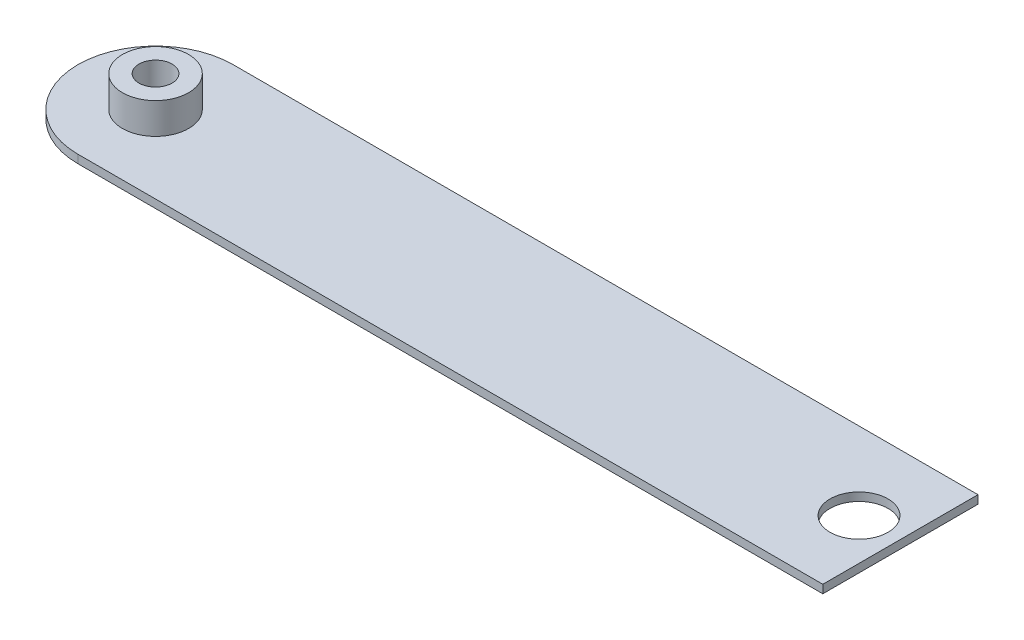
ISO-10303-21;
HEADER;
FILE_DESCRIPTION(('STEP AP214'),'2;1');
FILE_NAME('part.step','',(''),(''),'','','');
FILE_SCHEMA(('AUTOMOTIVE_DESIGN { 1 0 10303 214 1 1 1 1 }'));
ENDSEC;
DATA;
#1=APPLICATION_CONTEXT('core data for automotive mechanical design processes');
#2=APPLICATION_PROTOCOL_DEFINITION('international standard','automotive_design',2000,#1);
#3=PRODUCT_CONTEXT('',#1,'mechanical');
#4=PRODUCT('Part','Part','',(#3));
#5=PRODUCT_RELATED_PRODUCT_CATEGORY('part','',(#4));
#6=PRODUCT_DEFINITION_FORMATION('','',#4);
#7=PRODUCT_DEFINITION_CONTEXT('part definition',#1,'design');
#8=PRODUCT_DEFINITION('design','',#6,#7);
#9=PRODUCT_DEFINITION_SHAPE('','',#8);
#10=(LENGTH_UNIT() NAMED_UNIT(*) SI_UNIT(.MILLI.,.METRE.));
#11=(NAMED_UNIT(*) PLANE_ANGLE_UNIT() SI_UNIT($,.RADIAN.));
#12=(NAMED_UNIT(*) SI_UNIT($,.STERADIAN.) SOLID_ANGLE_UNIT());
#13=UNCERTAINTY_MEASURE_WITH_UNIT(LENGTH_MEASURE(1.E-05),#10,'distance_accuracy_value','');
#14=(GEOMETRIC_REPRESENTATION_CONTEXT(3) GLOBAL_UNCERTAINTY_ASSIGNED_CONTEXT((#13)) GLOBAL_UNIT_ASSIGNED_CONTEXT((#10,
#11,#12)) REPRESENTATION_CONTEXT('',''));
#15=CARTESIAN_POINT('',(0.,0.,0.));
#16=DIRECTION('',(0.,0.,1.));
#17=DIRECTION('',(1.,0.,0.));
#18=AXIS2_PLACEMENT_3D('',#15,#16,#17);
#19=CARTESIAN_POINT('',(0.,2.,0.));
#20=DIRECTION('',(0.,1.,0.));
#21=DIRECTION('',(0.,0.,1.));
#22=AXIS2_PLACEMENT_3D('',#19,#20,#21);
#23=PLANE('',#22);
#24=DIRECTION('',(1.,0.,0.));
#25=VECTOR('',#24,1.);
#26=CARTESIAN_POINT('',(0.,2.,-7.5));
#27=LINE('',#26,#25);
#28=CARTESIAN_POINT('',(0.,2.,-7.5));
#29=VERTEX_POINT('',#28);
#30=CARTESIAN_POINT('',(72.,2.,-7.5));
#31=VERTEX_POINT('',#30);
#32=EDGE_CURVE('E118',#29,#31,#27,.T.);
#33=ORIENTED_EDGE('',*,*,#32,.F.);
#34=CARTESIAN_POINT('',(0.,2.,0.));
#35=DIRECTION('',(0.,1.,0.));
#36=DIRECTION('',(0.,0.,1.));
#37=AXIS2_PLACEMENT_3D('',#34,#35,#36);
#38=CIRCLE('',#37,7.5);
#39=CARTESIAN_POINT('',(0.,2.,7.5));
#40=VERTEX_POINT('',#39);
#41=EDGE_CURVE('E115',#29,#40,#38,.T.);
#42=ORIENTED_EDGE('',*,*,#41,.T.);
#43=DIRECTION('',(1.,0.,0.));
#44=VECTOR('',#43,1.);
#45=CARTESIAN_POINT('',(0.,2.,7.5));
#46=LINE('',#45,#44);
#47=CARTESIAN_POINT('',(72.,2.,7.5));
#48=VERTEX_POINT('',#47);
#49=EDGE_CURVE('E112',#40,#48,#46,.T.);
#50=ORIENTED_EDGE('',*,*,#49,.T.);
#51=DIRECTION('',(0.,0.,-1.));
#52=VECTOR('',#51,1.);
#53=CARTESIAN_POINT('',(72.,2.,0.));
#54=LINE('',#53,#52);
#55=EDGE_CURVE('E66',#48,#31,#54,.T.);
#56=ORIENTED_EDGE('',*,*,#55,.T.);
#57=EDGE_LOOP('',(#33,#42,#50,#56));
#58=FACE_BOUND('',#57,.T.);
#59=CARTESIAN_POINT('',(68.,2.,0.));
#60=DIRECTION('',(0.,1.,0.));
#61=DIRECTION('',(0.,0.,1.));
#62=AXIS2_PLACEMENT_3D('',#59,#60,#61);
#63=CIRCLE('',#62,2.79999999999999);
#64=CARTESIAN_POINT('',(68.,2.,2.79999999999999));
#65=VERTEX_POINT('',#64);
#66=EDGE_CURVE('E122',#65,#65,#63,.T.);
#67=ORIENTED_EDGE('',*,*,#66,.F.);
#68=EDGE_LOOP('',(#67));
#69=FACE_BOUND('',#68,.T.);
#70=CARTESIAN_POINT('',(0.,2.,0.));
#71=DIRECTION('',(0.,1.,0.));
#72=DIRECTION('',(0.,0.,1.));
#73=AXIS2_PLACEMENT_3D('',#70,#71,#72);
#74=CIRCLE('',#73,3.2);
#75=CARTESIAN_POINT('',(0.,2.,3.2));
#76=VERTEX_POINT('',#75);
#77=EDGE_CURVE('E127',#76,#76,#74,.T.);
#78=ORIENTED_EDGE('',*,*,#77,.F.);
#79=EDGE_LOOP('',(#78));
#80=FACE_BOUND('',#79,.T.);
#81=ADVANCED_FACE('F41',(#58,#69,#80),#23,.T.);
#82=CARTESIAN_POINT('',(0.,2.,-7.5));
#83=DIRECTION('',(0.,0.,-1.));
#84=DIRECTION('',(-1.,0.,0.));
#85=AXIS2_PLACEMENT_3D('',#82,#83,#84);
#86=PLANE('',#85);
#87=DIRECTION('',(1.,0.,0.));
#88=VECTOR('',#87,1.);
#89=CARTESIAN_POINT('',(72.,1.2,-7.5));
#90=LINE('',#89,#88);
#91=CARTESIAN_POINT('',(0.,1.2,-7.5));
#92=VERTEX_POINT('',#91);
#93=CARTESIAN_POINT('',(72.,1.2,-7.5));
#94=VERTEX_POINT('',#93);
#95=EDGE_CURVE('E58',#92,#94,#90,.T.);
#96=ORIENTED_EDGE('',*,*,#95,.F.);
#97=DIRECTION('',(0.,-1.,0.));
#98=VECTOR('',#97,1.);
#99=CARTESIAN_POINT('',(0.,2.,-7.5));
#100=LINE('',#99,#98);
#101=EDGE_CURVE('E11',#29,#92,#100,.T.);
#102=ORIENTED_EDGE('',*,*,#101,.F.);
#103=ORIENTED_EDGE('',*,*,#32,.T.);
#104=DIRECTION('',(0.,-1.,0.));
#105=VECTOR('',#104,1.);
#106=CARTESIAN_POINT('',(72.,2.,-7.5));
#107=LINE('',#106,#105);
#108=EDGE_CURVE('E103',#31,#94,#107,.T.);
#109=ORIENTED_EDGE('',*,*,#108,.T.);
#110=EDGE_LOOP('',(#96,#102,#103,#109));
#111=FACE_BOUND('',#110,.T.);
#112=ADVANCED_FACE('F43',(#111),#86,.T.);
#113=CARTESIAN_POINT('',(0.,2.,0.));
#114=DIRECTION('',(0.,-1.,0.));
#115=DIRECTION('',(0.,0.,-1.));
#116=AXIS2_PLACEMENT_3D('',#113,#114,#115);
#117=CYLINDRICAL_SURFACE('',#116,7.5);
#118=ORIENTED_EDGE('',*,*,#101,.T.);
#119=CARTESIAN_POINT('',(0.,1.2,0.));
#120=DIRECTION('',(0.,1.,0.));
#121=DIRECTION('',(0.,0.,1.));
#122=AXIS2_PLACEMENT_3D('',#119,#120,#121);
#123=CIRCLE('',#122,7.5);
#124=CARTESIAN_POINT('',(0.,1.2,7.5));
#125=VERTEX_POINT('',#124);
#126=EDGE_CURVE('E138',#92,#125,#123,.T.);
#127=ORIENTED_EDGE('',*,*,#126,.T.);
#128=DIRECTION('',(0.,-1.,0.));
#129=VECTOR('',#128,1.);
#130=CARTESIAN_POINT('',(0.,2.,7.5));
#131=LINE('',#130,#129);
#132=EDGE_CURVE('E51',#40,#125,#131,.T.);
#133=ORIENTED_EDGE('',*,*,#132,.F.);
#134=ORIENTED_EDGE('',*,*,#41,.F.);
#135=EDGE_LOOP('',(#118,#127,#133,#134));
#136=FACE_BOUND('',#135,.T.);
#137=ADVANCED_FACE('F181',(#136),#117,.T.);
#138=CARTESIAN_POINT('',(0.,2.,7.5));
#139=DIRECTION('',(0.,0.,-1.));
#140=DIRECTION('',(-1.,0.,0.));
#141=AXIS2_PLACEMENT_3D('',#138,#139,#140);
#142=PLANE('',#141);
#143=ORIENTED_EDGE('',*,*,#132,.T.);
#144=DIRECTION('',(-1.,0.,0.));
#145=VECTOR('',#144,1.);
#146=CARTESIAN_POINT('',(72.,1.2,7.5));
#147=LINE('',#146,#145);
#148=CARTESIAN_POINT('',(72.,1.2,7.5));
#149=VERTEX_POINT('',#148);
#150=EDGE_CURVE('E85',#149,#125,#147,.T.);
#151=ORIENTED_EDGE('',*,*,#150,.F.);
#152=DIRECTION('',(0.,-1.,0.));
#153=VECTOR('',#152,1.);
#154=CARTESIAN_POINT('',(72.,2.,7.5));
#155=LINE('',#154,#153);
#156=EDGE_CURVE('E97',#48,#149,#155,.T.);
#157=ORIENTED_EDGE('',*,*,#156,.F.);
#158=ORIENTED_EDGE('',*,*,#49,.F.);
#159=EDGE_LOOP('',(#143,#151,#157,#158));
#160=FACE_BOUND('',#159,.T.);
#161=ADVANCED_FACE('F95',(#160),#142,.F.);
#162=CARTESIAN_POINT('',(72.,2.,0.));
#163=DIRECTION('',(-1.,0.,0.));
#164=DIRECTION('',(0.,0.,1.));
#165=AXIS2_PLACEMENT_3D('',#162,#163,#164);
#166=PLANE('',#165);
#167=ORIENTED_EDGE('',*,*,#156,.T.);
#168=DIRECTION('',(0.,0.,1.));
#169=VECTOR('',#168,1.);
#170=CARTESIAN_POINT('',(72.,1.2,7.5));
#171=LINE('',#170,#169);
#172=EDGE_CURVE('E82',#94,#149,#171,.T.);
#173=ORIENTED_EDGE('',*,*,#172,.F.);
#174=ORIENTED_EDGE('',*,*,#108,.F.);
#175=ORIENTED_EDGE('',*,*,#55,.F.);
#176=EDGE_LOOP('',(#167,#173,#174,#175));
#177=FACE_BOUND('',#176,.T.);
#178=ADVANCED_FACE('F101',(#177),#166,.F.);
#179=CARTESIAN_POINT('',(0.,0.2,0.));
#180=DIRECTION('',(0.,1.,0.));
#181=DIRECTION('',(0.,0.,1.));
#182=AXIS2_PLACEMENT_3D('',#179,#180,#181);
#183=CYLINDRICAL_SURFACE('',#182,1.6);
#184=CARTESIAN_POINT('',(0.,1.2,0.));
#185=DIRECTION('',(0.,1.,0.));
#186=DIRECTION('',(0.,0.,1.));
#187=AXIS2_PLACEMENT_3D('',#184,#185,#186);
#188=CIRCLE('',#187,1.6);
#189=CARTESIAN_POINT('',(0.,1.2,1.6));
#190=VERTEX_POINT('',#189);
#191=EDGE_CURVE('E141',#190,#190,#188,.F.);
#192=ORIENTED_EDGE('',*,*,#191,.T.);
#193=EDGE_LOOP('',(#192));
#194=FACE_BOUND('',#193,.T.);
#195=CARTESIAN_POINT('',(0.,5.,0.));
#196=DIRECTION('',(0.,1.,0.));
#197=DIRECTION('',(0.,0.,1.));
#198=AXIS2_PLACEMENT_3D('',#195,#196,#197);
#199=CIRCLE('',#198,1.6);
#200=CARTESIAN_POINT('',(0.,5.,1.6));
#201=VERTEX_POINT('',#200);
#202=EDGE_CURVE('E131',#201,#201,#199,.T.);
#203=ORIENTED_EDGE('',*,*,#202,.T.);
#204=EDGE_LOOP('',(#203));
#205=FACE_BOUND('',#204,.T.);
#206=ADVANCED_FACE('F159',(#194,#205),#183,.F.);
#207=CARTESIAN_POINT('',(68.,0.6,0.));
#208=DIRECTION('',(0.,1.,0.));
#209=DIRECTION('',(0.,0.,1.));
#210=AXIS2_PLACEMENT_3D('',#207,#208,#209);
#211=CYLINDRICAL_SURFACE('',#210,2.79999999999999);
#212=CARTESIAN_POINT('',(68.,1.2,0.));
#213=DIRECTION('',(0.,1.,0.));
#214=DIRECTION('',(0.,0.,1.));
#215=AXIS2_PLACEMENT_3D('',#212,#213,#214);
#216=CIRCLE('',#215,2.79999999999999);
#217=CARTESIAN_POINT('',(68.,1.2,2.79999999999999));
#218=VERTEX_POINT('',#217);
#219=EDGE_CURVE('E45',#218,#218,#216,.F.);
#220=ORIENTED_EDGE('',*,*,#219,.T.);
#221=EDGE_LOOP('',(#220));
#222=FACE_BOUND('',#221,.T.);
#223=ORIENTED_EDGE('',*,*,#66,.T.);
#224=EDGE_LOOP('',(#223));
#225=FACE_BOUND('',#224,.T.);
#226=ADVANCED_FACE('F150',(#222,#225),#211,.F.);
#227=CARTESIAN_POINT('',(0.,5.,0.));
#228=DIRECTION('',(0.,1.,0.));
#229=DIRECTION('',(0.,0.,1.));
#230=AXIS2_PLACEMENT_3D('',#227,#228,#229);
#231=PLANE('',#230);
#232=CARTESIAN_POINT('',(0.,5.,0.));
#233=DIRECTION('',(0.,1.,0.));
#234=DIRECTION('',(0.,0.,1.));
#235=AXIS2_PLACEMENT_3D('',#232,#233,#234);
#236=CIRCLE('',#235,3.2);
#237=CARTESIAN_POINT('',(0.,5.,3.2));
#238=VERTEX_POINT('',#237);
#239=EDGE_CURVE('E126',#238,#238,#236,.T.);
#240=ORIENTED_EDGE('',*,*,#239,.T.);
#241=EDGE_LOOP('',(#240));
#242=FACE_BOUND('',#241,.T.);
#243=ORIENTED_EDGE('',*,*,#202,.F.);
#244=EDGE_LOOP('',(#243));
#245=FACE_BOUND('',#244,.T.);
#246=ADVANCED_FACE('F165',(#242,#245),#231,.T.);
#247=CARTESIAN_POINT('',(0.,5.,0.));
#248=DIRECTION('',(0.,-1.,0.));
#249=DIRECTION('',(0.,0.,-1.));
#250=AXIS2_PLACEMENT_3D('',#247,#248,#249);
#251=CYLINDRICAL_SURFACE('',#250,3.2);
#252=ORIENTED_EDGE('',*,*,#239,.F.);
#253=EDGE_LOOP('',(#252));
#254=FACE_BOUND('',#253,.T.);
#255=ORIENTED_EDGE('',*,*,#77,.T.);
#256=EDGE_LOOP('',(#255));
#257=FACE_BOUND('',#256,.T.);
#258=ADVANCED_FACE('F155',(#254,#257),#251,.T.);
#259=CARTESIAN_POINT('',(0.,1.2,0.));
#260=DIRECTION('',(0.,1.,0.));
#261=DIRECTION('',(0.,0.,1.));
#262=AXIS2_PLACEMENT_3D('',#259,#260,#261);
#263=PLANE('',#262);
#264=ORIENTED_EDGE('',*,*,#219,.F.);
#265=EDGE_LOOP('',(#264));
#266=FACE_BOUND('',#265,.T.);
#267=ORIENTED_EDGE('',*,*,#191,.F.);
#268=EDGE_LOOP('',(#267));
#269=FACE_BOUND('',#268,.T.);
#270=ORIENTED_EDGE('',*,*,#95,.T.);
#271=ORIENTED_EDGE('',*,*,#172,.T.);
#272=ORIENTED_EDGE('',*,*,#150,.T.);
#273=ORIENTED_EDGE('',*,*,#126,.F.);
#274=EDGE_LOOP('',(#270,#271,#272,#273));
#275=FACE_BOUND('',#274,.T.);
#276=ADVANCED_FACE('F84',(#266,#269,#275),#263,.F.);
#277=CLOSED_SHELL('',(#81,#112,#137,#161,#178,#206,#226,#246,#258,#276));
#278=MANIFOLD_SOLID_BREP('B2',#277);
#279=ADVANCED_BREP_SHAPE_REPRESENTATION('',(#18,#278),#14);
#280=SHAPE_DEFINITION_REPRESENTATION(#9,#279);
ENDSEC;
END-ISO-10303-21;
